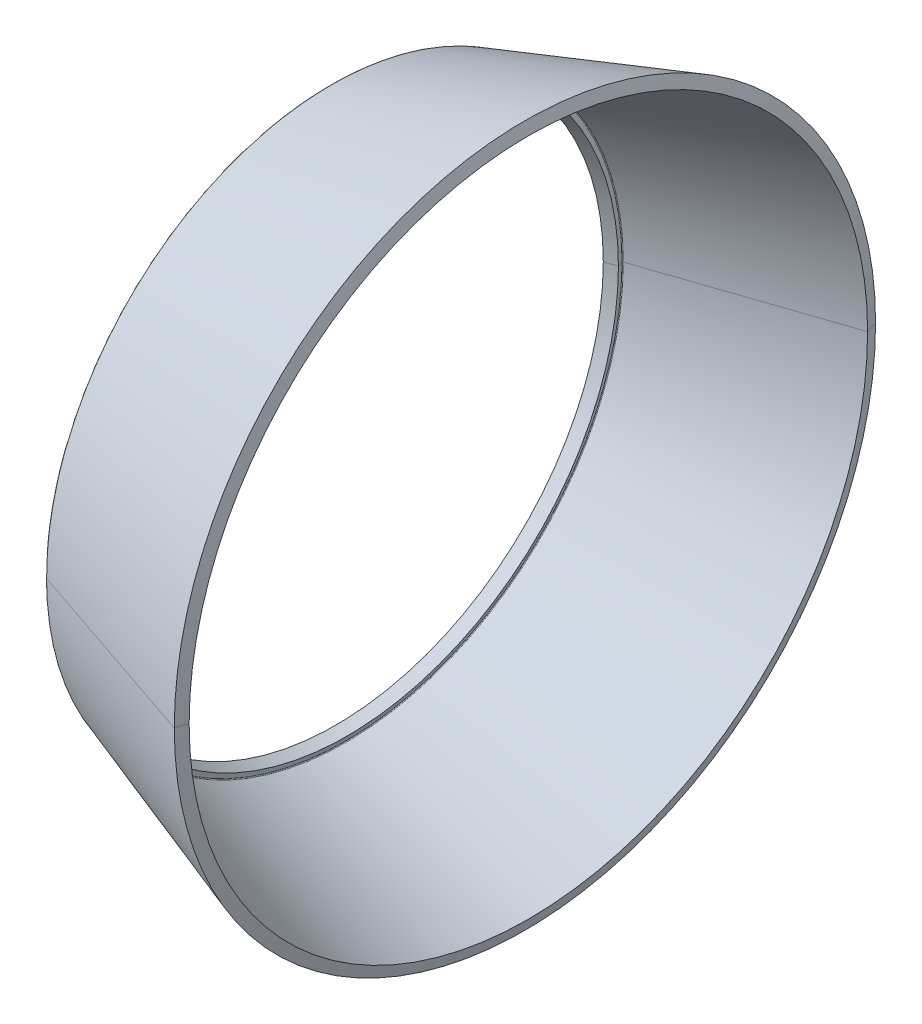
ISO-10303-21;
HEADER;
FILE_DESCRIPTION(('STEP AP214'),'2;1');
FILE_NAME('part.step','',(''),(''),'','','');
FILE_SCHEMA(('AUTOMOTIVE_DESIGN { 1 0 10303 214 1 1 1 1 }'));
ENDSEC;
DATA;
#1=APPLICATION_CONTEXT('core data for automotive mechanical design processes');
#2=APPLICATION_PROTOCOL_DEFINITION('international standard','automotive_design',2000,#1);
#3=PRODUCT_CONTEXT('',#1,'mechanical');
#4=PRODUCT('Part','Part','',(#3));
#5=PRODUCT_RELATED_PRODUCT_CATEGORY('part','',(#4));
#6=PRODUCT_DEFINITION_FORMATION('','',#4);
#7=PRODUCT_DEFINITION_CONTEXT('part definition',#1,'design');
#8=PRODUCT_DEFINITION('design','',#6,#7);
#9=PRODUCT_DEFINITION_SHAPE('','',#8);
#10=(LENGTH_UNIT() NAMED_UNIT(*) SI_UNIT(.MILLI.,.METRE.));
#11=(NAMED_UNIT(*) PLANE_ANGLE_UNIT() SI_UNIT($,.RADIAN.));
#12=(NAMED_UNIT(*) SI_UNIT($,.STERADIAN.) SOLID_ANGLE_UNIT());
#13=UNCERTAINTY_MEASURE_WITH_UNIT(LENGTH_MEASURE(1.E-05),#10,'distance_accuracy_value','');
#14=(GEOMETRIC_REPRESENTATION_CONTEXT(3) GLOBAL_UNCERTAINTY_ASSIGNED_CONTEXT((#13)) GLOBAL_UNIT_ASSIGNED_CONTEXT((#10,
#11,#12)) REPRESENTATION_CONTEXT('',''));
#15=CARTESIAN_POINT('',(0.,0.,0.));
#16=DIRECTION('',(0.,0.,1.));
#17=DIRECTION('',(1.,0.,0.));
#18=AXIS2_PLACEMENT_3D('',#15,#16,#17);
#19=CARTESIAN_POINT('',(14.927507170272,0.,0.));
#20=DIRECTION('',(1.,0.,0.));
#21=DIRECTION('',(0.,1.,0.));
#22=AXIS2_PLACEMENT_3D('',#19,#20,#21);
#23=CONICAL_SURFACE('',#22,29.401421976149,0.327240508102708);
#24=DIRECTION('',(0.946932934547547,0.,0.321431201766679));
#25=VECTOR('',#24,1.);
#26=CARTESIAN_POINT('',(-1.2772773652764,0.,23.900796559503));
#27=LINE('',#26,#25);
#28=CARTESIAN_POINT('',(-1.2772773652764,0.,23.900796559503));
#29=VERTEX_POINT('',#28);
#30=CARTESIAN_POINT('',(14.927507170272,0.,29.401421976149));
#31=VERTEX_POINT('',#30);
#32=EDGE_CURVE('E11',#29,#31,#27,.T.);
#33=ORIENTED_EDGE('',*,*,#32,.F.);
#34=CARTESIAN_POINT('',(-1.2772773652764,0.,0.));
#35=DIRECTION('',(1.,0.,0.));
#36=DIRECTION('',(0.,0.,-1.));
#37=AXIS2_PLACEMENT_3D('',#34,#35,#36);
#38=CIRCLE('',#37,23.900796559503);
#39=CARTESIAN_POINT('',(-1.2772773652764,-22.7310083125601,-7.3857523159847));
#40=VERTEX_POINT('',#39);
#41=EDGE_CURVE('E25',#29,#40,#38,.T.);
#42=ORIENTED_EDGE('',*,*,#41,.T.);
#43=CARTESIAN_POINT('',(-1.2772773652764,0.,0.));
#44=DIRECTION('',(1.,0.,0.));
#45=DIRECTION('',(0.,0.,-1.));
#46=AXIS2_PLACEMENT_3D('',#43,#44,#45);
#47=CIRCLE('',#46,23.900796559503);
#48=CARTESIAN_POINT('',(-1.2772773652764,0.,-23.900796559503));
#49=VERTEX_POINT('',#48);
#50=EDGE_CURVE('E385',#40,#49,#47,.T.);
#51=ORIENTED_EDGE('',*,*,#50,.T.);
#52=DIRECTION('',(0.946932934547547,0.,-0.321431201766679));
#53=VECTOR('',#52,1.);
#54=CARTESIAN_POINT('',(-1.2772773652764,0.,-23.900796559503));
#55=LINE('',#54,#53);
#56=CARTESIAN_POINT('',(14.927507170272,0.,-29.401421976149));
#57=VERTEX_POINT('',#56);
#58=EDGE_CURVE('E125',#49,#57,#55,.T.);
#59=ORIENTED_EDGE('',*,*,#58,.T.);
#60=CARTESIAN_POINT('',(14.927507170272,0.,0.));
#61=DIRECTION('',(1.,0.,0.));
#62=DIRECTION('',(0.,0.,-1.));
#63=AXIS2_PLACEMENT_3D('',#60,#61,#62);
#64=CIRCLE('',#63,29.401421976149);
#65=EDGE_CURVE('E377',#31,#57,#64,.T.);
#66=ORIENTED_EDGE('',*,*,#65,.F.);
#67=EDGE_LOOP('',(#33,#42,#51,#59,#66));
#68=FACE_BOUND('',#67,.T.);
#69=ADVANCED_FACE('F17',(#68),#23,.T.);
#70=CARTESIAN_POINT('',(15.217252371484,0.,0.));
#71=DIRECTION('',(-1.,0.,0.));
#72=DIRECTION('',(0.,1.,0.));
#73=AXIS2_PLACEMENT_3D('',#70,#71,#72);
#74=CONICAL_SURFACE('',#73,28.44373340214,1.27700505380673);
#75=DIRECTION('',(-0.289583125422371,0.,-0.95715286839178));
#76=VECTOR('',#75,1.);
#77=CARTESIAN_POINT('',(15.217252371484,0.,-28.44373340214));
#78=LINE('',#77,#76);
#79=CARTESIAN_POINT('',(15.217252371484,0.,-28.44373340214));
#80=VERTEX_POINT('',#79);
#81=EDGE_CURVE('E372',#80,#57,#78,.T.);
#82=ORIENTED_EDGE('',*,*,#81,.F.);
#83=CARTESIAN_POINT('',(15.217252371484,0.,0.));
#84=DIRECTION('',(1.,0.,0.));
#85=DIRECTION('',(0.,0.,-1.));
#86=AXIS2_PLACEMENT_3D('',#83,#84,#85);
#87=CIRCLE('',#86,28.44373340214);
#88=CARTESIAN_POINT('',(15.217252371484,0.,28.44373340214));
#89=VERTEX_POINT('',#88);
#90=EDGE_CURVE('E367',#89,#80,#87,.T.);
#91=ORIENTED_EDGE('',*,*,#90,.F.);
#92=DIRECTION('',(-0.289583125422371,0.,0.95715286839178));
#93=VECTOR('',#92,1.);
#94=CARTESIAN_POINT('',(15.217252371484,0.,28.44373340214));
#95=LINE('',#94,#93);
#96=EDGE_CURVE('E362',#89,#31,#95,.T.);
#97=ORIENTED_EDGE('',*,*,#96,.T.);
#98=ORIENTED_EDGE('',*,*,#65,.T.);
#99=EDGE_LOOP('',(#82,#91,#97,#98));
#100=FACE_BOUND('',#99,.T.);
#101=ADVANCED_FACE('F426',(#100),#74,.T.);
#102=CARTESIAN_POINT('',(15.217252371484,0.,0.));
#103=DIRECTION('',(-1.,0.,0.));
#104=DIRECTION('',(0.,-1.,0.));
#105=AXIS2_PLACEMENT_3D('',#102,#103,#104);
#106=CONICAL_SURFACE('',#105,28.44373340214,1.27700505380673);
#107=ORIENTED_EDGE('',*,*,#81,.T.);
#108=CARTESIAN_POINT('',(14.927507170272,0.,0.));
#109=DIRECTION('',(1.,0.,0.));
#110=DIRECTION('',(0.,0.,-1.));
#111=AXIS2_PLACEMENT_3D('',#108,#109,#110);
#112=CIRCLE('',#111,29.401421976149);
#113=EDGE_CURVE('E357',#57,#31,#112,.T.);
#114=ORIENTED_EDGE('',*,*,#113,.T.);
#115=ORIENTED_EDGE('',*,*,#96,.F.);
#116=CARTESIAN_POINT('',(15.217252371484,0.,0.));
#117=DIRECTION('',(1.,0.,0.));
#118=DIRECTION('',(0.,0.,-1.));
#119=AXIS2_PLACEMENT_3D('',#116,#117,#118);
#120=CIRCLE('',#119,28.44373340214);
#121=EDGE_CURVE('E352',#80,#89,#120,.T.);
#122=ORIENTED_EDGE('',*,*,#121,.F.);
#123=EDGE_LOOP('',(#107,#114,#115,#122));
#124=FACE_BOUND('',#123,.T.);
#125=ADVANCED_FACE('F430',(#124),#106,.T.);
#126=CARTESIAN_POINT('',(-0.0705951411819616,0.,0.));
#127=DIRECTION('',(1.,0.,0.));
#128=DIRECTION('',(0.,-1.,0.));
#129=AXIS2_PLACEMENT_3D('',#126,#127,#128);
#130=CONICAL_SURFACE('',#129,23.254357239224,0.327240508102658);
#131=DIRECTION('',(0.946932934547563,0.,0.321431201766631));
#132=VECTOR('',#131,1.);
#133=CARTESIAN_POINT('',(-0.0705951411819509,0.,23.254357239224));
#134=LINE('',#133,#132);
#135=CARTESIAN_POINT('',(-0.0705951411819509,0.,23.254357239224));
#136=VERTEX_POINT('',#135);
#137=EDGE_CURVE('E340',#136,#89,#134,.T.);
#138=ORIENTED_EDGE('',*,*,#137,.F.);
#139=CARTESIAN_POINT('',(-0.0705951411819616,0.,0.));
#140=DIRECTION('',(1.,0.,0.));
#141=DIRECTION('',(0.,0.,-1.));
#142=AXIS2_PLACEMENT_3D('',#139,#140,#141);
#143=CIRCLE('',#142,23.254357239224);
#144=CARTESIAN_POINT('',(-0.0705951411819614,22.1162079846194,7.1859915801863));
#145=VERTEX_POINT('',#144);
#146=EDGE_CURVE('E337',#145,#136,#143,.T.);
#147=ORIENTED_EDGE('',*,*,#146,.F.);
#148=CARTESIAN_POINT('',(-0.0705951411819616,0.,0.));
#149=DIRECTION('',(1.,0.,0.));
#150=DIRECTION('',(0.,0.,-1.));
#151=AXIS2_PLACEMENT_3D('',#148,#149,#150);
#152=CIRCLE('',#151,23.254357239224);
#153=CARTESIAN_POINT('',(-0.0705951411819616,0.,-23.254357239224));
#154=VERTEX_POINT('',#153);
#155=EDGE_CURVE('E330',#154,#145,#152,.T.);
#156=ORIENTED_EDGE('',*,*,#155,.F.);
#157=DIRECTION('',(0.946932934547563,0.,-0.321431201766631));
#158=VECTOR('',#157,1.);
#159=CARTESIAN_POINT('',(-0.0705951411819474,0.,-23.254357239224));
#160=LINE('',#159,#158);
#161=EDGE_CURVE('E338',#154,#80,#160,.T.);
#162=ORIENTED_EDGE('',*,*,#161,.T.);
#163=ORIENTED_EDGE('',*,*,#121,.T.);
#164=EDGE_LOOP('',(#138,#147,#156,#162,#163));
#165=FACE_BOUND('',#164,.T.);
#166=ADVANCED_FACE('F435',(#165),#130,.F.);
#167=CARTESIAN_POINT('',(-0.0705951411819616,0.,0.));
#168=DIRECTION('',(1.,0.,0.));
#169=DIRECTION('',(0.,1.,0.));
#170=AXIS2_PLACEMENT_3D('',#167,#168,#169);
#171=CONICAL_SURFACE('',#170,23.254357239224,0.327240508102658);
#172=ORIENTED_EDGE('',*,*,#137,.T.);
#173=ORIENTED_EDGE('',*,*,#90,.T.);
#174=ORIENTED_EDGE('',*,*,#161,.F.);
#175=CARTESIAN_POINT('',(-0.0705951411819616,0.,0.));
#176=DIRECTION('',(1.,0.,0.));
#177=DIRECTION('',(0.,0.,-1.));
#178=AXIS2_PLACEMENT_3D('',#175,#176,#177);
#179=CIRCLE('',#178,23.254357239224);
#180=CARTESIAN_POINT('',(-0.0705951411819615,-22.1162079846194,-7.1859915801863));
#181=VERTEX_POINT('',#180);
#182=EDGE_CURVE('E333',#181,#154,#179,.T.);
#183=ORIENTED_EDGE('',*,*,#182,.F.);
#184=CARTESIAN_POINT('',(-0.0705951411819616,0.,0.));
#185=DIRECTION('',(1.,0.,0.));
#186=DIRECTION('',(0.,0.,-1.));
#187=AXIS2_PLACEMENT_3D('',#184,#185,#186);
#188=CIRCLE('',#187,23.254357239224);
#189=EDGE_CURVE('E447',#136,#181,#188,.T.);
#190=ORIENTED_EDGE('',*,*,#189,.F.);
#191=EDGE_LOOP('',(#172,#173,#174,#183,#190));
#192=FACE_BOUND('',#191,.T.);
#193=ADVANCED_FACE('F301',(#192),#171,.F.);
#194=CARTESIAN_POINT('',(-0.0491663943968791,0.,0.));
#195=DIRECTION('',(1.,0.,0.));
#196=DIRECTION('',(0.,0.309016994374947,-0.951056516295154));
#197=AXIS2_PLACEMENT_3D('',#194,#195,#196);
#198=TOROIDAL_SURFACE('',#197,23.1912283769205,0.0666666666671871);
#199=CARTESIAN_POINT('',(-0.0491663943968791,-22.0561688687593,-7.16648368889896));
#200=DIRECTION('',(0.,0.309016994374941,-0.951056516295156));
#201=DIRECTION('',(-0.321431201773725,-0.900586737893664,-0.292618369307786));
#202=AXIS2_PLACEMENT_3D('',#199,#200,#201);
#203=CIRCLE('',#202,0.0666666666671874);
#204=CARTESIAN_POINT('',(-0.11297658562364,-22.0378082075302,-7.16051794842974));
#205=VERTEX_POINT('',#204);
#206=EDGE_CURVE('E448',#181,#205,#203,.T.);
#207=ORIENTED_EDGE('',*,*,#206,.T.);
#208=CARTESIAN_POINT('',(-0.112976585623639,0.,0.));
#209=DIRECTION('',(1.,0.,0.));
#210=DIRECTION('',(0.,0.,1.));
#211=AXIS2_PLACEMENT_3D('',#208,#209,#210);
#212=CIRCLE('',#211,23.171922835226);
#213=CARTESIAN_POINT('',(-0.112976585623639,0.,23.171922835226));
#214=VERTEX_POINT('',#213);
#215=EDGE_CURVE('E267',#214,#205,#212,.T.);
#216=ORIENTED_EDGE('',*,*,#215,.F.);
#217=CARTESIAN_POINT('',(-0.112976585623639,0.,0.));
#218=DIRECTION('',(1.,0.,0.));
#219=DIRECTION('',(0.,0.951056516295156,0.309016994374939));
#220=AXIS2_PLACEMENT_3D('',#217,#218,#219);
#221=CIRCLE('',#220,23.171922835226);
#222=CARTESIAN_POINT('',(-0.11297658562364,22.0378082075302,7.16051794842975));
#223=VERTEX_POINT('',#222);
#224=EDGE_CURVE('E242',#223,#214,#221,.T.);
#225=ORIENTED_EDGE('',*,*,#224,.F.);
#226=CARTESIAN_POINT('',(-0.0491663943968791,22.0561688687593,7.16648368889896));
#227=DIRECTION('',(0.,-0.309016994374941,0.951056516295156));
#228=DIRECTION('',(-0.321431201773723,0.900586737893665,0.292618369307786));
#229=AXIS2_PLACEMENT_3D('',#226,#227,#228);
#230=CIRCLE('',#229,0.0666666666671874);
#231=EDGE_CURVE('E324',#145,#223,#230,.T.);
#232=ORIENTED_EDGE('',*,*,#231,.F.);
#233=ORIENTED_EDGE('',*,*,#146,.T.);
#234=ORIENTED_EDGE('',*,*,#189,.T.);
#235=EDGE_LOOP('',(#207,#216,#225,#232,#233,#234));
#236=FACE_BOUND('',#235,.T.);
#237=ADVANCED_FACE('F296',(#236),#198,.F.);
#238=CARTESIAN_POINT('',(-0.0491663943968791,0.,0.));
#239=DIRECTION('',(1.,0.,0.));
#240=DIRECTION('',(0.,-0.309016994374947,0.951056516295154));
#241=AXIS2_PLACEMENT_3D('',#238,#239,#240);
#242=TOROIDAL_SURFACE('',#241,23.1912283769205,0.0666666666671871);
#243=ORIENTED_EDGE('',*,*,#206,.F.);
#244=ORIENTED_EDGE('',*,*,#182,.T.);
#245=ORIENTED_EDGE('',*,*,#155,.T.);
#246=ORIENTED_EDGE('',*,*,#231,.T.);
#247=CARTESIAN_POINT('',(-0.112976585623641,0.,0.));
#248=DIRECTION('',(1.,0.,0.));
#249=DIRECTION('',(0.,0.,-1.));
#250=AXIS2_PLACEMENT_3D('',#247,#248,#249);
#251=CIRCLE('',#250,23.171922835226);
#252=CARTESIAN_POINT('',(-0.112976585623641,0.,-23.171922835226));
#253=VERTEX_POINT('',#252);
#254=EDGE_CURVE('E326',#253,#223,#251,.T.);
#255=ORIENTED_EDGE('',*,*,#254,.F.);
#256=CARTESIAN_POINT('',(-0.112976585623639,0.,0.));
#257=DIRECTION('',(1.,0.,0.));
#258=DIRECTION('',(0.,-0.951056516295153,-0.30901699437495));
#259=AXIS2_PLACEMENT_3D('',#256,#257,#258);
#260=CIRCLE('',#259,23.171922835226);
#261=EDGE_CURVE('E256',#205,#253,#260,.T.);
#262=ORIENTED_EDGE('',*,*,#261,.F.);
#263=EDGE_LOOP('',(#243,#244,#245,#246,#255,#262));
#264=FACE_BOUND('',#263,.T.);
#265=ADVANCED_FACE('F287',(#264),#242,.F.);
#266=CARTESIAN_POINT('',(0.0132256647806528,0.,0.));
#267=DIRECTION('',(-1.,0.,0.));
#268=DIRECTION('',(0.,1.,0.));
#269=AXIS2_PLACEMENT_3D('',#266,#267,#268);
#270=CONICAL_SURFACE('',#269,22.754789254684,1.27700505380675);
#271=DIRECTION('',(-0.289583125422349,0.,-0.957152868391786));
#272=VECTOR('',#271,1.);
#273=CARTESIAN_POINT('',(0.0132256647806546,0.,-22.754789254684));
#274=LINE('',#273,#272);
#275=CARTESIAN_POINT('',(0.0132256647806528,0.,-22.754789254684));
#276=VERTEX_POINT('',#275);
#277=EDGE_CURVE('E276',#276,#253,#274,.T.);
#278=ORIENTED_EDGE('',*,*,#277,.F.);
#279=CARTESIAN_POINT('',(0.0132256647806528,0.,0.));
#280=DIRECTION('',(1.,0.,0.));
#281=DIRECTION('',(0.,0.,-1.));
#282=AXIS2_PLACEMENT_3D('',#279,#280,#281);
#283=CIRCLE('',#282,22.754789254684);
#284=CARTESIAN_POINT('',(0.0132256647806546,0.,22.754789254684));
#285=VERTEX_POINT('',#284);
#286=EDGE_CURVE('E270',#285,#276,#283,.T.);
#287=ORIENTED_EDGE('',*,*,#286,.F.);
#288=DIRECTION('',(-0.289583125422349,0.,0.957152868391786));
#289=VECTOR('',#288,1.);
#290=CARTESIAN_POINT('',(0.0132256647806546,0.,22.754789254684));
#291=LINE('',#290,#289);
#292=EDGE_CURVE('E268',#285,#214,#291,.T.);
#293=ORIENTED_EDGE('',*,*,#292,.T.);
#294=ORIENTED_EDGE('',*,*,#215,.T.);
#295=ORIENTED_EDGE('',*,*,#261,.T.);
#296=EDGE_LOOP('',(#278,#287,#293,#294,#295));
#297=FACE_BOUND('',#296,.T.);
#298=ADVANCED_FACE('F222',(#297),#270,.T.);
#299=CARTESIAN_POINT('',(0.0132256647806528,0.,0.));
#300=DIRECTION('',(-1.,0.,0.));
#301=DIRECTION('',(0.,-1.,0.));
#302=AXIS2_PLACEMENT_3D('',#299,#300,#301);
#303=CONICAL_SURFACE('',#302,22.754789254684,1.27700505380675);
#304=ORIENTED_EDGE('',*,*,#277,.T.);
#305=ORIENTED_EDGE('',*,*,#254,.T.);
#306=ORIENTED_EDGE('',*,*,#224,.T.);
#307=ORIENTED_EDGE('',*,*,#292,.F.);
#308=CARTESIAN_POINT('',(0.0132256647806528,0.,0.));
#309=DIRECTION('',(1.,0.,0.));
#310=DIRECTION('',(0.,0.,-1.));
#311=AXIS2_PLACEMENT_3D('',#308,#309,#310);
#312=CIRCLE('',#311,22.754789254684);
#313=EDGE_CURVE('E271',#276,#285,#312,.T.);
#314=ORIENTED_EDGE('',*,*,#313,.F.);
#315=EDGE_LOOP('',(#304,#305,#306,#307,#314));
#316=FACE_BOUND('',#315,.T.);
#317=ADVANCED_FACE('F217',(#316),#303,.T.);
#318=CARTESIAN_POINT('',(-0.934237255423617,0.,0.));
#319=DIRECTION('',(1.,0.,0.));
#320=DIRECTION('',(0.,-1.,0.));
#321=AXIS2_PLACEMENT_3D('',#318,#319,#320);
#322=CONICAL_SURFACE('',#321,22.433178152187,0.327240508102639);
#323=DIRECTION('',(0.946932934547569,0.,0.321431201766614));
#324=VECTOR('',#323,1.);
#325=CARTESIAN_POINT('',(-0.934237255423617,0.,22.433178152187));
#326=LINE('',#325,#324);
#327=CARTESIAN_POINT('',(-0.934237255423616,0.,22.433178152187));
#328=VERTEX_POINT('',#327);
#329=EDGE_CURVE('E413',#328,#285,#326,.T.);
#330=ORIENTED_EDGE('',*,*,#329,.F.);
#331=CARTESIAN_POINT('',(-0.934237255423617,0.,0.));
#332=DIRECTION('',(1.,0.,0.));
#333=DIRECTION('',(0.,0.,-1.));
#334=AXIS2_PLACEMENT_3D('',#331,#332,#333);
#335=CIRCLE('',#334,22.433178152187);
#336=CARTESIAN_POINT('',(-0.934237255423617,0.,-22.433178152187));
#337=VERTEX_POINT('',#336);
#338=EDGE_CURVE('E408',#337,#328,#335,.T.);
#339=ORIENTED_EDGE('',*,*,#338,.F.);
#340=DIRECTION('',(0.946932934547569,0.,-0.321431201766614));
#341=VECTOR('',#340,1.);
#342=CARTESIAN_POINT('',(-0.934237255423617,0.,-22.433178152187));
#343=LINE('',#342,#341);
#344=EDGE_CURVE('E399',#337,#276,#343,.T.);
#345=ORIENTED_EDGE('',*,*,#344,.T.);
#346=ORIENTED_EDGE('',*,*,#313,.T.);
#347=EDGE_LOOP('',(#330,#339,#345,#346));
#348=FACE_BOUND('',#347,.T.);
#349=ADVANCED_FACE('F213',(#348),#322,.F.);
#350=CARTESIAN_POINT('',(-0.934237255423617,0.,0.));
#351=DIRECTION('',(1.,0.,0.));
#352=DIRECTION('',(0.,1.,0.));
#353=AXIS2_PLACEMENT_3D('',#350,#351,#352);
#354=CONICAL_SURFACE('',#353,22.433178152187,0.327240508102639);
#355=ORIENTED_EDGE('',*,*,#329,.T.);
#356=ORIENTED_EDGE('',*,*,#286,.T.);
#357=ORIENTED_EDGE('',*,*,#344,.F.);
#358=CARTESIAN_POINT('',(-0.934237255423617,0.,0.));
#359=DIRECTION('',(1.,0.,0.));
#360=DIRECTION('',(0.,0.,-1.));
#361=AXIS2_PLACEMENT_3D('',#358,#359,#360);
#362=CIRCLE('',#361,22.433178152187);
#363=EDGE_CURVE('E398',#328,#337,#362,.T.);
#364=ORIENTED_EDGE('',*,*,#363,.F.);
#365=EDGE_LOOP('',(#355,#356,#357,#364));
#366=FACE_BOUND('',#365,.T.);
#367=ADVANCED_FACE('F209',(#366),#354,.F.);
#368=CARTESIAN_POINT('',(-1.3408495319389,0.,0.));
#369=DIRECTION('',(-1.,0.,0.));
#370=DIRECTION('',(0.,1.,0.));
#371=AXIS2_PLACEMENT_3D('',#368,#369,#370);
#372=CONICAL_SURFACE('',#371,23.777144953506,1.27700505380669);
#373=DIRECTION('',(-0.289583125422407,0.,-0.957152868391769));
#374=VECTOR('',#373,1.);
#375=CARTESIAN_POINT('',(-0.934237255423616,0.,-22.433178152187));
#376=LINE('',#375,#374);
#377=CARTESIAN_POINT('',(-1.3408495319389,0.,-23.777144953506));
#378=VERTEX_POINT('',#377);
#379=EDGE_CURVE('E397',#337,#378,#376,.T.);
#380=ORIENTED_EDGE('',*,*,#379,.T.);
#381=CARTESIAN_POINT('',(-1.3408495319389,-22.6134086469263,-7.34754186834986));
#382=CARTESIAN_POINT('',(-1.3408495319389,-22.5172327252784,-7.64355186283306));
#383=CARTESIAN_POINT('',(-1.3408495319389,-22.4152384372887,-7.93767111350817));
#384=CARTESIAN_POINT('',(-1.3408495319389,-22.199784339416,-8.52167976051671));
#385=CARTESIAN_POINT('',(-1.3408495319389,-22.086324529533,-8.81156915685013));
#386=CARTESIAN_POINT('',(-1.3408495319389,-21.8481105986635,-9.38666972844973));
#387=CARTESIAN_POINT('',(-1.3408495319389,-21.7233564776771,-9.67188090371591));
#388=CARTESIAN_POINT('',(-1.3408495319389,-21.4627472874748,-10.2371856275325));
#389=CARTESIAN_POINT('',(-1.3408495319389,-21.3268922182589,-10.5172791760828));
#390=CARTESIAN_POINT('',(-1.3408495319389,-21.0442903420338,-11.0719166635608));
#391=CARTESIAN_POINT('',(-1.3408495319389,-20.8975435350246,-11.3464606024884));
#392=CARTESIAN_POINT('',(-1.3408495319389,-20.5933845280257,-11.8895755703818));
#393=CARTESIAN_POINT('',(-1.3408495319389,-20.435972328036,-12.1581465993476));
#394=CARTESIAN_POINT('',(-1.3408495319389,-20.1107252340209,-12.6889016231523));
#395=CARTESIAN_POINT('',(-1.3408495319389,-19.9428903399955,-12.9510856179911));
#396=CARTESIAN_POINT('',(-1.3408495319389,-19.5970566523107,-13.4686623067292));
#397=CARTESIAN_POINT('',(-1.3408495319389,-19.4190578586514,-13.7240550006283));
#398=CARTESIAN_POINT('',(-1.3408495319389,-19.0531708315544,-14.2276552899541));
#399=CARTESIAN_POINT('',(-1.3408495319389,-18.8652825981168,-14.4758628853806));
#400=CARTESIAN_POINT('',(-1.3408495319389,-18.4799064018711,-14.9647102597762));
#401=CARTESIAN_POINT('',(-1.3408495319389,-18.2824184390632,-15.2053500387451));
#402=CARTESIAN_POINT('',(-1.3408495319389,-17.8781472961021,-15.6786907310915));
#403=CARTESIAN_POINT('',(-1.3408495319389,-17.671364115949,-15.911391644469));
#404=CARTESIAN_POINT('',(-1.3408495319389,-17.2488213830002,-16.3684957977003));
#405=CARTESIAN_POINT('',(-1.3408495319389,-17.0330618302044,-16.5928990375542));
#406=CARTESIAN_POINT('',(-1.3408495319389,-16.5928990375549,-17.0330618302049));
#407=CARTESIAN_POINT('',(-1.3408495319389,-16.3684957977011,-17.2488213830018));
#408=CARTESIAN_POINT('',(-1.3408495319389,-15.9113916444684,-17.6713641159473));
#409=CARTESIAN_POINT('',(-1.3408495319389,-15.6786907310893,-17.878147296096));
#410=CARTESIAN_POINT('',(-1.3408495319389,-15.2053500387474,-18.2824184390692));
#411=CARTESIAN_POINT('',(-1.3408495319389,-14.9647102597846,-18.4799064018937));
#412=CARTESIAN_POINT('',(-1.3408495319389,-14.4758628853724,-18.8652825980941));
#413=CARTESIAN_POINT('',(-1.3408495319389,-14.227655289923,-19.05317083147));
#414=CARTESIAN_POINT('',(-1.3408495319389,-13.7240550006595,-19.4190578587357));
#415=CARTESIAN_POINT('',(-1.3408495319389,-13.4686623068454,-19.5970566526255));
#416=CARTESIAN_POINT('',(-1.3408495319389,-12.951085617875,-19.9428903396805));
#417=CARTESIAN_POINT('',(-1.3408495319389,-12.6889016227188,-20.1107252328457));
#418=CARTESIAN_POINT('',(-1.3408495319389,-12.1581465997812,-20.4359723292111));
#419=CARTESIAN_POINT('',(-1.3408495319389,-11.8895755719999,-20.5933845324112));
#420=CARTESIAN_POINT('',(-1.3408495319389,-11.3464606008706,-20.897543530639));
#421=CARTESIAN_POINT('',(-1.3408495319389,-11.0719166575226,-21.0442903256666));
#422=CARTESIAN_POINT('',(-1.3408495319389,-10.5172791821212,-21.326892234626));
#423=CARTESIAN_POINT('',(-1.3408495319389,-10.2371856500678,-21.4627473485578));
#424=CARTESIAN_POINT('',(-1.3408495319389,-9.67188088118073,-21.7233564165941));
#425=CARTESIAN_POINT('',(-1.3408495319389,-9.38666964434705,-21.8481103706987));
#426=CARTESIAN_POINT('',(-1.3408495319389,-8.81156924095298,-22.0863247574977));
#427=CARTESIAN_POINT('',(-1.3408495319389,-8.52168007439258,-22.199785190192));
#428=CARTESIAN_POINT('',(-1.3408495319389,-7.93767079963248,-22.4152375865126));
#429=CARTESIAN_POINT('',(-1.3408495319389,-7.64355069143277,-22.517229550139));
#430=CARTESIAN_POINT('',(-1.3408495319389,-7.05153304526712,-22.7095877437136));
#431=CARTESIAN_POINT('',(-1.3408495319389,-6.75363550730118,-22.7999539736619));
#432=CARTESIAN_POINT('',(-1.3408495319389,-6.15452233807245,-22.9689213631765));
#433=CARTESIAN_POINT('',(-1.3408495319389,-5.85330670680966,-23.0475225227428));
#434=CARTESIAN_POINT('',(-1.3408495319389,-5.24802180344213,-23.1928385687064));
#435=CARTESIAN_POINT('',(-1.3408495319389,-4.94395253133739,-23.2595534551038));
#436=CARTESIAN_POINT('',(-1.3408495319389,-4.33342919987007,-23.3809941057215));
#437=CARTESIAN_POINT('',(-1.3408495319389,-4.02697514050748,-23.4357198699419));
#438=CARTESIAN_POINT('',(-1.3408495319389,-3.41215476146415,-23.5330978164949));
#439=CARTESIAN_POINT('',(-1.3408495319389,-3.10378844178341,-23.5757499988275));
#440=CARTESIAN_POINT('',(-1.3408495319389,-2.48561903184246,-23.6489153007161));
#441=CARTESIAN_POINT('',(-1.3408495319389,-2.17581594158225,-23.679428420272));
#442=CARTESIAN_POINT('',(-1.3408495319389,-1.55525064250187,-23.7282674813986));
#443=CARTESIAN_POINT('',(-1.3408495319389,-1.24448843368169,-23.7465934229694));
#444=CARTESIAN_POINT('',(-1.3408495319389,-0.622484226621119,-23.7710338499262));
#445=CARTESIAN_POINT('',(-1.3408495319389,-0.311242228380725,-23.7771483353122));
#446=CARTESIAN_POINT('',(-1.3408495319389,0.,-23.777144953506));
#447=B_SPLINE_CURVE_WITH_KNOTS('',3,(#381,#382,#383,#384,#385,#386,#387,#388,#389,#390,#391,
#392,#393,#394,#395,#396,#397,#398,#399,#400,#401,#402,#403,#404,#405,#406,#407,#408,#409,#410,
#411,#412,#413,#414,#415,#416,#417,#418,#419,#420,#421,#422,#423,#424,#425,#426,#427,#428,#429,
#430,#431,#432,#433,#434,#435,#436,#437,#438,#439,#440,#441,#442,#443,#444,#445,#446),
.UNSPECIFIED.,.F.,.F.,(4,2,2,2,2,2,2,2,2,2,2,2,2,2,2,2,2,2,2,2,2,2,2,2,2,2,2,2,2,2,2,2,4),(0.,
0.93366630321783,1.86733260643566,2.8009989096535,3.73466521287133,4.66833151608916,
5.60199781930699,6.53566412252482,7.46933042574265,8.40299672896049,9.33666303217832,
10.2703293353962,11.203995638614,12.1376619418318,13.0713282450497,14.0049945482675,
14.9386608514853,15.8723271547031,16.805993457921,17.7396597611388,18.6733260643566,
19.6069923675745,20.5406586707923,21.4743249740101,22.407991277228,23.3416575804458,
24.2753238836636,25.2089901868814,26.1426564900993,27.0763227933171,28.009989096535,
28.9436553997528,29.8773217029706),.UNSPECIFIED.);
#448=CARTESIAN_POINT('',(-1.3408495319389,-22.6134086469263,-7.34754186834987));
#449=VERTEX_POINT('',#448);
#450=EDGE_CURVE('E161',#449,#378,#447,.T.);
#451=ORIENTED_EDGE('',*,*,#450,.F.);
#452=CARTESIAN_POINT('',(-1.3408495319389,0.,0.));
#453=DIRECTION('',(1.,0.,0.));
#454=DIRECTION('',(0.,0.,-1.));
#455=AXIS2_PLACEMENT_3D('',#452,#453,#454);
#456=CIRCLE('',#455,23.777144953506);
#457=CARTESIAN_POINT('',(-1.3408495319389,0.,23.777144953506));
#458=VERTEX_POINT('',#457);
#459=EDGE_CURVE('E189',#458,#449,#456,.T.);
#460=ORIENTED_EDGE('',*,*,#459,.F.);
#461=DIRECTION('',(-0.289583125422407,0.,0.957152868391769));
#462=VECTOR('',#461,1.);
#463=CARTESIAN_POINT('',(-0.934237255423616,0.,22.433178152187));
#464=LINE('',#463,#462);
#465=EDGE_CURVE('E187',#328,#458,#464,.T.);
#466=ORIENTED_EDGE('',*,*,#465,.F.);
#467=ORIENTED_EDGE('',*,*,#363,.T.);
#468=EDGE_LOOP('',(#380,#451,#460,#466,#467));
#469=FACE_BOUND('',#468,.T.);
#470=ADVANCED_FACE('F200',(#469),#372,.F.);
#471=CARTESIAN_POINT('',(-1.3408495319389,0.,0.));
#472=DIRECTION('',(-1.,0.,0.));
#473=DIRECTION('',(0.,-1.,0.));
#474=AXIS2_PLACEMENT_3D('',#471,#472,#473);
#475=CONICAL_SURFACE('',#474,23.777144953506,1.27700505380669);
#476=ORIENTED_EDGE('',*,*,#379,.F.);
#477=ORIENTED_EDGE('',*,*,#338,.T.);
#478=ORIENTED_EDGE('',*,*,#465,.T.);
#479=CARTESIAN_POINT('',(-1.3408495319389,22.6134086469263,7.34754186834987));
#480=CARTESIAN_POINT('',(-1.3408495319389,22.5172327252784,7.64355186283307));
#481=CARTESIAN_POINT('',(-1.3408495319389,22.4152384372887,7.93767111350819));
#482=CARTESIAN_POINT('',(-1.3408495319389,22.199784339416,8.52167976051673));
#483=CARTESIAN_POINT('',(-1.3408495319389,22.086324529533,8.81156915685015));
#484=CARTESIAN_POINT('',(-1.3408495319389,21.8481105986635,9.38666972844975));
#485=CARTESIAN_POINT('',(-1.3408495319389,21.7233564776771,9.67188090371593));
#486=CARTESIAN_POINT('',(-1.3408495319389,21.4627472874748,10.2371856275325));
#487=CARTESIAN_POINT('',(-1.3408495319389,21.3268922182589,10.5172791760828));
#488=CARTESIAN_POINT('',(-1.3408495319389,21.0442903420338,11.0719166635608));
#489=CARTESIAN_POINT('',(-1.3408495319389,20.8975435350245,11.3464606024885));
#490=CARTESIAN_POINT('',(-1.3408495319389,20.5933845280256,11.8895755703819));
#491=CARTESIAN_POINT('',(-1.3408495319389,20.435972328036,12.1581465993476));
#492=CARTESIAN_POINT('',(-1.3408495319389,20.1107252340209,12.6889016231523));
#493=CARTESIAN_POINT('',(-1.3408495319389,19.9428903399954,12.9510856179912));
#494=CARTESIAN_POINT('',(-1.3408495319389,19.5970566523107,13.4686623067292));
#495=CARTESIAN_POINT('',(-1.3408495319389,19.4190578586514,13.7240550006284));
#496=CARTESIAN_POINT('',(-1.3408495319389,19.0531708315544,14.2276552899541));
#497=CARTESIAN_POINT('',(-1.3408495319389,18.8652825981167,14.4758628853807));
#498=CARTESIAN_POINT('',(-1.3408495319389,18.4799064018711,14.9647102597762));
#499=CARTESIAN_POINT('',(-1.3408495319389,18.2824184390632,15.2053500387451));
#500=CARTESIAN_POINT('',(-1.3408495319389,17.8781472961021,15.6786907310916));
#501=CARTESIAN_POINT('',(-1.3408495319389,17.671364115949,15.911391644469));
#502=CARTESIAN_POINT('',(-1.3408495319389,17.2488213830001,16.3684957977004));
#503=CARTESIAN_POINT('',(-1.3408495319389,17.0330618302044,16.5928990375542));
#504=CARTESIAN_POINT('',(-1.3408495319389,16.5928990375548,17.033061830205));
#505=CARTESIAN_POINT('',(-1.3408495319389,16.3684957977011,17.2488213830018));
#506=CARTESIAN_POINT('',(-1.3408495319389,15.9113916444683,17.6713641159473));
#507=CARTESIAN_POINT('',(-1.3408495319389,15.6786907310893,17.878147296096));
#508=CARTESIAN_POINT('',(-1.3408495319389,15.2053500387474,18.2824184390692));
#509=CARTESIAN_POINT('',(-1.3408495319389,14.9647102597845,18.4799064018937));
#510=CARTESIAN_POINT('',(-1.3408495319389,14.4758628853723,18.8652825980941));
#511=CARTESIAN_POINT('',(-1.3408495319389,14.227655289923,19.05317083147));
#512=CARTESIAN_POINT('',(-1.3408495319389,13.7240550006595,19.4190578587357));
#513=CARTESIAN_POINT('',(-1.3408495319389,13.4686623068454,19.5970566526255));
#514=CARTESIAN_POINT('',(-1.3408495319389,12.951085617875,19.9428903396806));
#515=CARTESIAN_POINT('',(-1.3408495319389,12.6889016227188,20.1107252328458));
#516=CARTESIAN_POINT('',(-1.3408495319389,12.1581465997812,20.4359723292111));
#517=CARTESIAN_POINT('',(-1.3408495319389,11.8895755719998,20.5933845324112));
#518=CARTESIAN_POINT('',(-1.3408495319389,11.3464606008705,20.897543530639));
#519=CARTESIAN_POINT('',(-1.3408495319389,11.0719166575225,21.0442903256667));
#520=CARTESIAN_POINT('',(-1.3408495319389,10.5172791821211,21.3268922346261));
#521=CARTESIAN_POINT('',(-1.3408495319389,10.2371856500677,21.4627473485578));
#522=CARTESIAN_POINT('',(-1.3408495319389,9.67188088118067,21.7233564165941));
#523=CARTESIAN_POINT('',(-1.3408495319389,9.38666964434699,21.8481103706988));
#524=CARTESIAN_POINT('',(-1.3408495319389,8.81156924095291,22.0863247574977));
#525=CARTESIAN_POINT('',(-1.3408495319389,8.52168007439252,22.199785190192));
#526=CARTESIAN_POINT('',(-1.3408495319389,7.93767079963241,22.4152375865127));
#527=CARTESIAN_POINT('',(-1.3408495319389,7.6435506914327,22.517229550139));
#528=CARTESIAN_POINT('',(-1.3408495319389,7.05153304526705,22.7095877437136));
#529=CARTESIAN_POINT('',(-1.3408495319389,6.75363550730112,22.799953973662));
#530=CARTESIAN_POINT('',(-1.3408495319389,6.15452233807238,22.9689213631766));
#531=CARTESIAN_POINT('',(-1.3408495319389,5.85330670680958,23.0475225227428));
#532=CARTESIAN_POINT('',(-1.3408495319389,5.24802180344204,23.1928385687064));
#533=CARTESIAN_POINT('',(-1.3408495319389,4.9439525313373,23.2595534551038));
#534=CARTESIAN_POINT('',(-1.3408495319389,4.33342919986998,23.3809941057215));
#535=CARTESIAN_POINT('',(-1.3408495319389,4.0269751405074,23.4357198699419));
#536=CARTESIAN_POINT('',(-1.3408495319389,3.41215476146408,23.5330978164949));
#537=CARTESIAN_POINT('',(-1.3408495319389,3.10378844178334,23.5757499988276));
#538=CARTESIAN_POINT('',(-1.3408495319389,2.48561903184238,23.6489153007161));
#539=CARTESIAN_POINT('',(-1.3408495319389,2.17581594158217,23.679428420272));
#540=CARTESIAN_POINT('',(-1.3408495319389,1.55525064250178,23.7282674813986));
#541=CARTESIAN_POINT('',(-1.3408495319389,1.24448843368161,23.7465934229694));
#542=CARTESIAN_POINT('',(-1.3408495319389,0.622484226621033,23.7710338499262));
#543=CARTESIAN_POINT('',(-1.3408495319389,0.311242228380636,23.7771483353122));
#544=CARTESIAN_POINT('',(-1.3408495319389,0.,23.777144953506));
#545=B_SPLINE_CURVE_WITH_KNOTS('',3,(#479,#480,#481,#482,#483,#484,#485,#486,#487,#488,#489,
#490,#491,#492,#493,#494,#495,#496,#497,#498,#499,#500,#501,#502,#503,#504,#505,#506,#507,#508,
#509,#510,#511,#512,#513,#514,#515,#516,#517,#518,#519,#520,#521,#522,#523,#524,#525,#526,#527,
#528,#529,#530,#531,#532,#533,#534,#535,#536,#537,#538,#539,#540,#541,#542,#543,#544),
.UNSPECIFIED.,.F.,.F.,(4,2,2,2,2,2,2,2,2,2,2,2,2,2,2,2,2,2,2,2,2,2,2,2,2,2,2,2,2,2,2,2,4),(0.,
0.933666303217835,1.86733260643567,2.8009989096535,3.73466521287134,4.66833151608917,
5.601997819307,6.53566412252484,7.46933042574267,8.40299672896051,9.33666303217834,
10.2703293353962,11.203995638614,12.1376619418318,13.0713282450497,14.0049945482675,
14.9386608514853,15.8723271547032,16.805993457921,17.7396597611388,18.6733260643567,
19.6069923675745,20.5406586707924,21.4743249740102,22.407991277228,23.3416575804459,
24.2753238836637,25.2089901868815,26.1426564900994,27.0763227933172,28.009989096535,
28.9436553997529,29.8773217029707),.UNSPECIFIED.);
#546=CARTESIAN_POINT('',(-1.3408495319389,22.6134086469263,7.34754186834987));
#547=VERTEX_POINT('',#546);
#548=EDGE_CURVE('E186',#547,#458,#545,.T.);
#549=ORIENTED_EDGE('',*,*,#548,.F.);
#550=CARTESIAN_POINT('',(-1.3408495319389,0.,-23.777144953506));
#551=CARTESIAN_POINT('',(-1.3408495319389,0.466864126862616,-23.7771620573925));
#552=CARTESIAN_POINT('',(-1.3408495319389,0.933726506659361,-23.7633953053979));
#553=CARTESIAN_POINT('',(-1.3408495319389,1.86583275722799,-23.7084169255264));
#554=CARTESIAN_POINT('',(-1.3408495319389,2.33107662799988,-23.6672052976496));
#555=CARTESIAN_POINT('',(-1.3408495319389,3.25833084562575,-23.5574600018941));
#556=CARTESIAN_POINT('',(-1.3408495319389,3.72034119247974,-23.4889263340154));
#557=CARTESIAN_POINT('',(-1.3408495319389,4.63952606809272,-23.3247800770962));
#558=CARTESIAN_POINT('',(-1.3408495319389,5.09670059685172,-23.2291674880556));
#559=CARTESIAN_POINT('',(-1.3408495319389,6.00462791339984,-23.0111936033937));
#560=CARTESIAN_POINT('',(-1.3408495319389,6.45538070118897,-22.8888323077725));
#561=CARTESIAN_POINT('',(-1.3408495319389,7.34890099653307,-22.6177858413504));
#562=CARTESIAN_POINT('',(-1.3408495319389,7.79166850408805,-22.4691006705495));
#563=CARTESIAN_POINT('',(-1.3408495319389,8.66768236993679,-22.1459221061552));
#564=CARTESIAN_POINT('',(-1.3408495319389,9.10092872823055,-21.9714287125619));
#565=CARTESIAN_POINT('',(-1.3408495319389,9.95639746105291,-21.5972390094995));
#566=CARTESIAN_POINT('',(-1.3408495319389,10.3786198355815,-21.3975427000306));
#567=CARTESIAN_POINT('',(-1.3408495319389,11.2105760040621,-20.9736398602622));
#568=CARTESIAN_POINT('',(-1.3408495319389,11.6203097980141,-20.7494333299626));
#569=CARTESIAN_POINT('',(-1.3408495319389,12.4258675292207,-20.2772877735733));
#570=CARTESIAN_POINT('',(-1.3408495319389,12.8216914664754,-20.0293487474836));
#571=CARTESIAN_POINT('',(-1.3408495319389,13.5980564582449,-19.5105982448226));
#572=CARTESIAN_POINT('',(-1.3408495319389,13.9785975127599,-19.2397867682514));
#573=CARTESIAN_POINT('',(-1.3408495319389,14.7230767259999,-18.6762307501043));
#574=CARTESIAN_POINT('',(-1.3408495319389,15.0870148847251,-18.3834862085286));
#575=CARTESIAN_POINT('',(-1.3408495319389,15.7970258851115,-17.7770795266368));
#576=CARTESIAN_POINT('',(-1.3408495319389,16.1430987267729,-17.4634173863208));
#577=CARTESIAN_POINT('',(-1.3408495319389,16.8161786426085,-16.8162635318022));
#578=CARTESIAN_POINT('',(-1.3408495319389,17.1431857167828,-16.4827718175995));
#579=CARTESIAN_POINT('',(-1.3408495319389,17.7769997821663,-15.7971156245699));
#580=CARTESIAN_POINT('',(-1.3408495319389,18.0838067733754,-15.444951145743));
#581=CARTESIAN_POINT('',(-1.3408495319389,18.6761564269869,-14.7231710044365));
#582=CARTESIAN_POINT('',(-1.3408495319389,18.9616990893893,-14.3535553419568));
#583=CARTESIAN_POINT('',(-1.3408495319389,19.5105296008164,-13.5981549486257));
#584=CARTESIAN_POINT('',(-1.3408495319389,19.773817449841,-13.2123702177743));
#585=CARTESIAN_POINT('',(-1.3408495319389,20.2772250469849,-12.4259698899158));
#586=CARTESIAN_POINT('',(-1.3408495319389,20.5173447951043,-12.0253542929087));
#587=CARTESIAN_POINT('',(-1.3408495319389,20.9735832679458,-11.2106818799617));
#588=CARTESIAN_POINT('',(-1.3408495319389,21.189701992668,-10.7966250640218));
#589=CARTESIAN_POINT('',(-1.3408495319389,21.5971887504878,-9.9565064850574));
#590=CARTESIAN_POINT('',(-1.3408495319389,21.7885567835854,-9.53044472203295));
#591=CARTESIAN_POINT('',(-1.3408495319389,22.145878344611,-8.66779416326706));
#592=CARTESIAN_POINT('',(-1.3408495319389,22.3118318725389,-8.23120536752562));
#593=CARTESIAN_POINT('',(-1.3408495319389,22.6177487670449,-7.34901517363766));
#594=CARTESIAN_POINT('',(-1.3408495319389,22.757712133623,-6.90341377549113));
#595=CARTESIAN_POINT('',(-1.3408495319389,23.0111632032155,-6.00474406988247));
#596=CARTESIAN_POINT('',(-1.3408495319389,23.12465090623,-5.55167576242034));
#597=CARTESIAN_POINT('',(-1.3408495319389,23.3247569853808,-4.63964383216142));
#598=CARTESIAN_POINT('',(-1.3408495319389,23.4113753615173,-4.18068020936464));
#599=CARTESIAN_POINT('',(-1.3408495319389,23.5574423249195,-3.25844969260698));
#600=CARTESIAN_POINT('',(-1.3408495319389,23.6168909121853,-2.79518279864609));
#601=CARTESIAN_POINT('',(-1.3408495319389,23.7084120910148,-1.86595270844226));
#602=CARTESIAN_POINT('',(-1.3408495319389,23.7404846825784,-1.39998951219933));
#603=CARTESIAN_POINT('',(-1.3408495319389,23.7771425903171,-0.466983148103454));
#604=CARTESIAN_POINT('',(-1.3408495319389,23.7817279064922,6.00197494908571E-05));
#605=CARTESIAN_POINT('',(-1.3408495319389,23.7633954585215,0.933606283468195));
#606=CARTESIAN_POINT('',(-1.3408495319389,23.7404776943757,1.40010937933395));
#607=CARTESIAN_POINT('',(-1.3408495319389,23.6672182072949,2.33095720474985));
#608=CARTESIAN_POINT('',(-1.3408495319389,23.6168764843599,2.79530193429999));
#609=CARTESIAN_POINT('',(-1.3408495319389,23.4889451040916,3.72022268288275));
#610=CARTESIAN_POINT('',(-1.3408495319389,23.4113554467583,4.18079870191537));
#611=CARTESIAN_POINT('',(-1.3408495319389,23.229192114067,5.09658302929178));
#612=CARTESIAN_POINT('',(-1.3408495319389,23.1246184387091,5.55179133763555));
#613=CARTESIAN_POINT('',(-1.3408495319389,22.8888693131524,6.45526631482179));
#614=CARTESIAN_POINT('',(-1.3408495319389,22.7576938629536,6.90353298366424));
#615=CARTESIAN_POINT('',(-1.3408495319389,22.6134086469263,7.3475418683498));
#616=B_SPLINE_CURVE_WITH_KNOTS('',3,(#550,#551,#552,#553,#554,#555,#556,#557,#558,#559,#560,
#561,#562,#563,#564,#565,#566,#567,#568,#569,#570,#571,#572,#573,#574,#575,#576,#577,#578,#579,
#580,#581,#582,#583,#584,#585,#586,#587,#588,#589,#590,#591,#592,#593,#594,#595,#596,#597,#598,
#599,#600,#601,#602,#603,#604,#605,#606,#607,#608,#609,#610,#611,#612,#613,#614,#615),
.UNSPECIFIED.,.F.,.F.,(4,2,2,2,2,2,2,2,2,2,2,2,2,2,2,2,2,2,2,2,2,2,2,2,2,2,2,2,2,2,2,2,4),(0.,
1.40038696786555,2.80077393573111,4.20116090359667,5.60154787146222,7.00193483932777,
8.40232180719332,9.80270877505888,11.2030957429244,12.60348271079,14.0038696786555,
15.4042566465211,16.8046436143866,18.2050305822522,19.6054175501178,21.0058045179833,
22.4061914858489,23.8065784537144,25.20696542158,26.6073523894455,28.0077393573111,
29.4081263251766,30.8085132930422,32.2089002609077,33.6092872287733,35.0096741966388,
36.4100611645044,37.8104481323699,39.2108351002355,40.6112220681011,42.0116090359666,
43.4119960038322,44.8123829716977),.UNSPECIFIED.);
#617=EDGE_CURVE('E113',#378,#547,#616,.T.);
#618=ORIENTED_EDGE('',*,*,#617,.F.);
#619=EDGE_LOOP('',(#476,#477,#478,#549,#618));
#620=FACE_BOUND('',#619,.T.);
#621=ADVANCED_FACE('F147',(#620),#475,.F.);
#622=CARTESIAN_POINT('',(-1.24513424510031,0.,0.));
#623=DIRECTION('',(1.,0.,0.));
#624=DIRECTION('',(0.,-0.309016994374947,0.951056516295154));
#625=AXIS2_PLACEMENT_3D('',#622,#623,#624);
#626=TOROIDAL_SURFACE('',#625,23.8061032660485,0.0999999999995279);
#627=CARTESIAN_POINT('',(-1.24513424510031,-22.6409496387708,-7.35649047905394));
#628=DIRECTION('',(0.,0.309016994374949,-0.951056516295153));
#629=DIRECTION('',(-0.321431201762443,-0.900586737897304,-0.292618369308978));
#630=AXIS2_PLACEMENT_3D('',#627,#628,#629);
#631=CIRCLE('',#630,0.0999999999995269);
#632=EDGE_CURVE('E117',#40,#449,#631,.T.);
#633=ORIENTED_EDGE('',*,*,#632,.T.);
#634=ORIENTED_EDGE('',*,*,#450,.T.);
#635=ORIENTED_EDGE('',*,*,#617,.T.);
#636=CARTESIAN_POINT('',(-1.24513424510031,22.6409496387708,7.35649047905394));
#637=DIRECTION('',(0.,-0.309016994374949,0.951056516295153));
#638=DIRECTION('',(-0.321431201762441,0.900586737897304,0.292618369308978));
#639=AXIS2_PLACEMENT_3D('',#636,#637,#638);
#640=CIRCLE('',#639,0.0999999999995269);
#641=CARTESIAN_POINT('',(-1.2772773652764,22.7310083125601,7.3857523159847));
#642=VERTEX_POINT('',#641);
#643=EDGE_CURVE('E103',#642,#547,#640,.T.);
#644=ORIENTED_EDGE('',*,*,#643,.F.);
#645=CARTESIAN_POINT('',(-1.2772773652764,0.,0.));
#646=DIRECTION('',(1.,0.,0.));
#647=DIRECTION('',(0.,0.,-1.));
#648=AXIS2_PLACEMENT_3D('',#645,#646,#647);
#649=CIRCLE('',#648,23.900796559503);
#650=EDGE_CURVE('E109',#49,#642,#649,.T.);
#651=ORIENTED_EDGE('',*,*,#650,.F.);
#652=ORIENTED_EDGE('',*,*,#50,.F.);
#653=EDGE_LOOP('',(#633,#634,#635,#644,#651,#652));
#654=FACE_BOUND('',#653,.T.);
#655=ADVANCED_FACE('F106',(#654),#626,.T.);
#656=CARTESIAN_POINT('',(14.927507170272,0.,0.));
#657=DIRECTION('',(1.,0.,0.));
#658=DIRECTION('',(0.,-1.,0.));
#659=AXIS2_PLACEMENT_3D('',#656,#657,#658);
#660=CONICAL_SURFACE('',#659,29.401421976149,0.327240508102708);
#661=ORIENTED_EDGE('',*,*,#32,.T.);
#662=ORIENTED_EDGE('',*,*,#113,.F.);
#663=ORIENTED_EDGE('',*,*,#58,.F.);
#664=ORIENTED_EDGE('',*,*,#650,.T.);
#665=CARTESIAN_POINT('',(-1.2772773652764,0.,0.));
#666=DIRECTION('',(1.,0.,0.));
#667=DIRECTION('',(0.,0.,-1.));
#668=AXIS2_PLACEMENT_3D('',#665,#666,#667);
#669=CIRCLE('',#668,23.900796559503);
#670=EDGE_CURVE('E119',#642,#29,#669,.T.);
#671=ORIENTED_EDGE('',*,*,#670,.T.);
#672=EDGE_LOOP('',(#661,#662,#663,#664,#671));
#673=FACE_BOUND('',#672,.T.);
#674=ADVANCED_FACE('F123',(#673),#660,.T.);
#675=CARTESIAN_POINT('',(-1.24513424510031,0.,0.));
#676=DIRECTION('',(1.,0.,0.));
#677=DIRECTION('',(0.,0.309016994374947,-0.951056516295154));
#678=AXIS2_PLACEMENT_3D('',#675,#676,#677);
#679=TOROIDAL_SURFACE('',#678,23.8061032660485,0.0999999999995279);
#680=ORIENTED_EDGE('',*,*,#632,.F.);
#681=ORIENTED_EDGE('',*,*,#41,.F.);
#682=ORIENTED_EDGE('',*,*,#670,.F.);
#683=ORIENTED_EDGE('',*,*,#643,.T.);
#684=ORIENTED_EDGE('',*,*,#548,.T.);
#685=ORIENTED_EDGE('',*,*,#459,.T.);
#686=EDGE_LOOP('',(#680,#681,#682,#683,#684,#685));
#687=FACE_BOUND('',#686,.T.);
#688=ADVANCED_FACE('F120',(#687),#679,.T.);
#689=CLOSED_SHELL('',(#69,#101,#125,#166,#193,#237,#265,#298,#317,#349,#367,#470,#621,#655,#674,#688));
#690=MANIFOLD_SOLID_BREP('B1',#689);
#691=ADVANCED_BREP_SHAPE_REPRESENTATION('',(#18,#690),#14);
#692=SHAPE_DEFINITION_REPRESENTATION(#9,#691);
ENDSEC;
END-ISO-10303-21;
